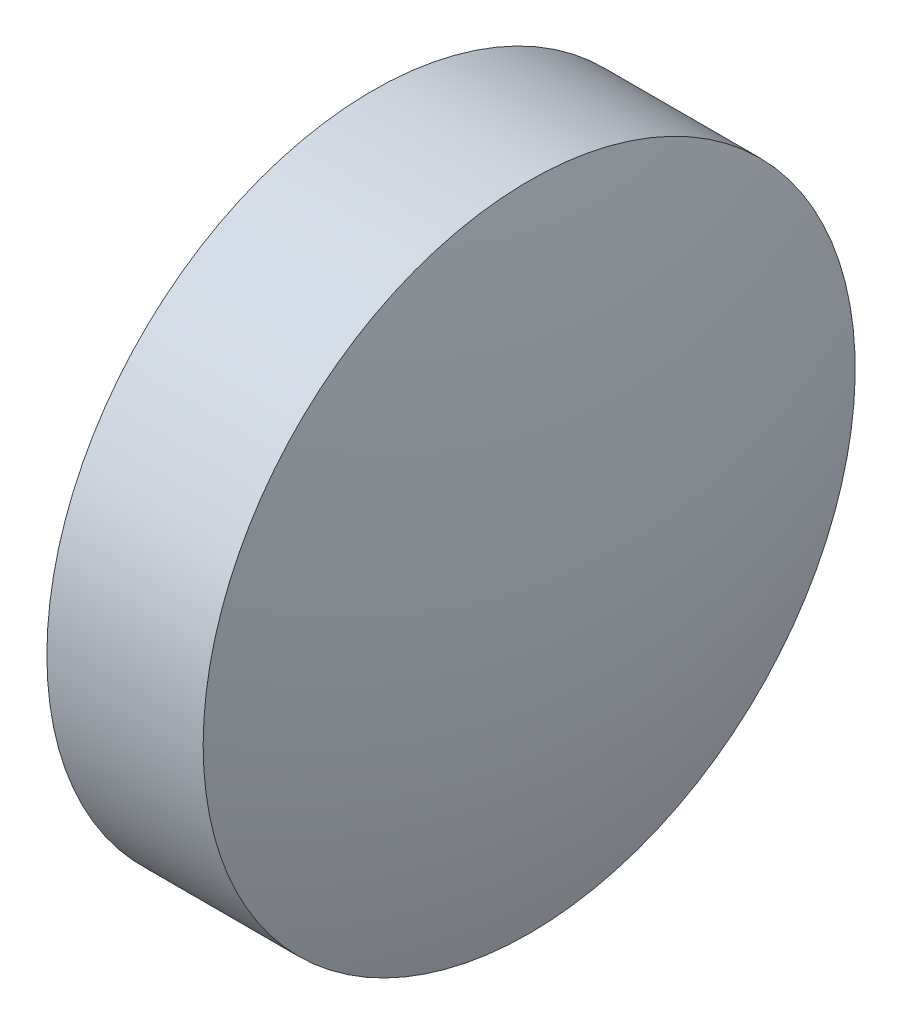
ISO-10303-21;
HEADER;
FILE_DESCRIPTION(('STEP AP214'),'2;1');
FILE_NAME('part.step','',(''),(''),'','','');
FILE_SCHEMA(('AUTOMOTIVE_DESIGN { 1 0 10303 214 1 1 1 1 }'));
ENDSEC;
DATA;
#1=APPLICATION_CONTEXT('core data for automotive mechanical design processes');
#2=APPLICATION_PROTOCOL_DEFINITION('international standard','automotive_design',2000,#1);
#3=PRODUCT_CONTEXT('',#1,'mechanical');
#4=PRODUCT('Part','Part','',(#3));
#5=PRODUCT_RELATED_PRODUCT_CATEGORY('part','',(#4));
#6=PRODUCT_DEFINITION_FORMATION('','',#4);
#7=PRODUCT_DEFINITION_CONTEXT('part definition',#1,'design');
#8=PRODUCT_DEFINITION('design','',#6,#7);
#9=PRODUCT_DEFINITION_SHAPE('','',#8);
#10=(LENGTH_UNIT() NAMED_UNIT(*) SI_UNIT(.MILLI.,.METRE.));
#11=(NAMED_UNIT(*) PLANE_ANGLE_UNIT() SI_UNIT($,.RADIAN.));
#12=(NAMED_UNIT(*) SI_UNIT($,.STERADIAN.) SOLID_ANGLE_UNIT());
#13=UNCERTAINTY_MEASURE_WITH_UNIT(LENGTH_MEASURE(1.E-05),#10,'distance_accuracy_value','');
#14=(GEOMETRIC_REPRESENTATION_CONTEXT(3) GLOBAL_UNCERTAINTY_ASSIGNED_CONTEXT((#13)) GLOBAL_UNIT_ASSIGNED_CONTEXT((#10,
#11,#12)) REPRESENTATION_CONTEXT('',''));
#15=CARTESIAN_POINT('',(0.,0.,0.));
#16=DIRECTION('',(0.,0.,1.));
#17=DIRECTION('',(1.,0.,0.));
#18=AXIS2_PLACEMENT_3D('',#15,#16,#17);
#19=CARTESIAN_POINT('',(598.711648002552,-17.2011839619728,0.));
#20=DIRECTION('',(-1.,0.,0.));
#21=DIRECTION('',(0.,-1.,0.));
#22=AXIS2_PLACEMENT_3D('',#19,#20,#21);
#23=SPHERICAL_SURFACE('',#22,10.3699999999999);
#24=CARTESIAN_POINT('',(608.591648002552,-17.201183961973,0.));
#25=DIRECTION('',(-1.,0.,0.));
#26=DIRECTION('',(0.,0.,1.));
#27=AXIS2_PLACEMENT_3D('',#24,#25,#26);
#28=CIRCLE('',#27,3.15);
#29=CARTESIAN_POINT('',(608.591648002552,-17.201183961973,3.15));
#30=VERTEX_POINT('',#29);
#31=EDGE_CURVE('E10',#30,#30,#28,.T.);
#32=ORIENTED_EDGE('',*,*,#31,.F.);
#33=EDGE_LOOP('',(#32));
#34=FACE_BOUND('',#33,.T.);
#35=ADVANCED_FACE('F35',(#34),#23,.T.);
#36=CARTESIAN_POINT('',(606.27593759001,-17.201183961973,0.));
#37=DIRECTION('',(-1.,0.,0.));
#38=DIRECTION('',(0.,0.,1.));
#39=AXIS2_PLACEMENT_3D('',#36,#37,#38);
#40=CYLINDRICAL_SURFACE('',#39,3.15);
#41=CARTESIAN_POINT('',(607.081648002552,-17.201183961973,0.));
#42=DIRECTION('',(-1.,0.,0.));
#43=DIRECTION('',(0.,0.,1.));
#44=AXIS2_PLACEMENT_3D('',#41,#42,#43);
#45=CIRCLE('',#44,3.15);
#46=CARTESIAN_POINT('',(607.081648002552,-17.201183961973,3.15));
#47=VERTEX_POINT('',#46);
#48=EDGE_CURVE('E41',#47,#47,#45,.T.);
#49=ORIENTED_EDGE('',*,*,#48,.F.);
#50=EDGE_LOOP('',(#49));
#51=FACE_BOUND('',#50,.T.);
#52=ORIENTED_EDGE('',*,*,#31,.T.);
#53=EDGE_LOOP('',(#52));
#54=FACE_BOUND('',#53,.T.);
#55=ADVANCED_FACE('F49',(#51,#54),#40,.T.);
#56=CARTESIAN_POINT('',(607.081648002552,-17.201183961973,0.));
#57=DIRECTION('',(1.,0.,0.));
#58=DIRECTION('',(0.,0.,-1.));
#59=AXIS2_PLACEMENT_3D('',#56,#57,#58);
#60=PLANE('',#59);
#61=ORIENTED_EDGE('',*,*,#48,.T.);
#62=EDGE_LOOP('',(#61));
#63=FACE_BOUND('',#62,.T.);
#64=ADVANCED_FACE('F47',(#63),#60,.F.);
#65=CLOSED_SHELL('',(#35,#55,#64));
#66=MANIFOLD_SOLID_BREP('B2',#65);
#67=ADVANCED_BREP_SHAPE_REPRESENTATION('',(#18,#66),#14);
#68=SHAPE_DEFINITION_REPRESENTATION(#9,#67);
ENDSEC;
END-ISO-10303-21;
